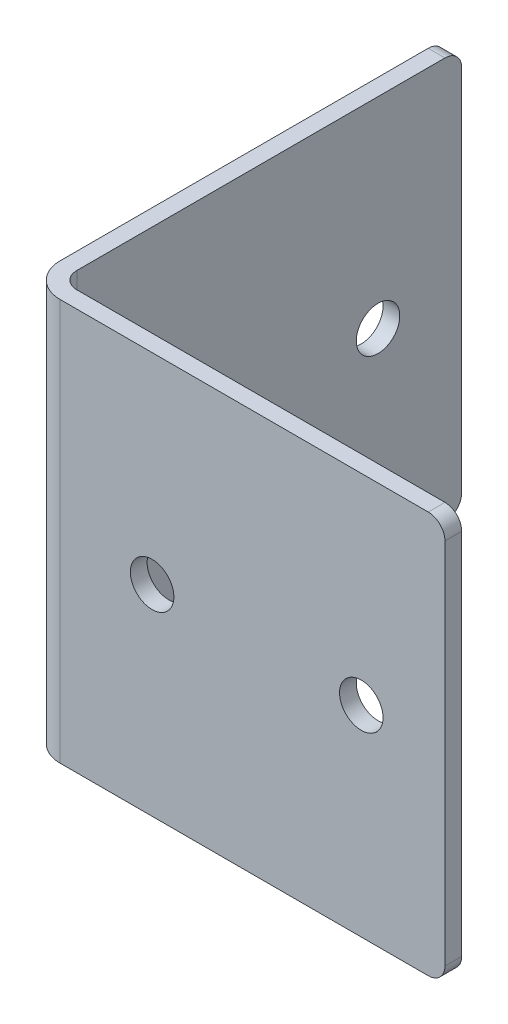
ISO-10303-21;
HEADER;
FILE_DESCRIPTION(('STEP AP214'),'2;1');
FILE_NAME('part.step','',(''),(''),'','','');
FILE_SCHEMA(('AUTOMOTIVE_DESIGN { 1 0 10303 214 1 1 1 1 }'));
ENDSEC;
DATA;
#1=APPLICATION_CONTEXT('core data for automotive mechanical design processes');
#2=APPLICATION_PROTOCOL_DEFINITION('international standard','automotive_design',2000,#1);
#3=PRODUCT_CONTEXT('',#1,'mechanical');
#4=PRODUCT('Part','Part','',(#3));
#5=PRODUCT_RELATED_PRODUCT_CATEGORY('part','',(#4));
#6=PRODUCT_DEFINITION_FORMATION('','',#4);
#7=PRODUCT_DEFINITION_CONTEXT('part definition',#1,'design');
#8=PRODUCT_DEFINITION('design','',#6,#7);
#9=PRODUCT_DEFINITION_SHAPE('','',#8);
#10=(LENGTH_UNIT() NAMED_UNIT(*) SI_UNIT(.MILLI.,.METRE.));
#11=(NAMED_UNIT(*) PLANE_ANGLE_UNIT() SI_UNIT($,.RADIAN.));
#12=(NAMED_UNIT(*) SI_UNIT($,.STERADIAN.) SOLID_ANGLE_UNIT());
#13=UNCERTAINTY_MEASURE_WITH_UNIT(LENGTH_MEASURE(1.E-05),#10,'distance_accuracy_value','');
#14=(GEOMETRIC_REPRESENTATION_CONTEXT(3) GLOBAL_UNCERTAINTY_ASSIGNED_CONTEXT((#13)) GLOBAL_UNIT_ASSIGNED_CONTEXT((#10,
#11,#12)) REPRESENTATION_CONTEXT('',''));
#15=CARTESIAN_POINT('',(0.,0.,0.));
#16=DIRECTION('',(0.,0.,1.));
#17=DIRECTION('',(1.,0.,0.));
#18=AXIS2_PLACEMENT_3D('',#15,#16,#17);
#19=CARTESIAN_POINT('',(2.,0.,0.));
#20=DIRECTION('',(1.,0.,0.));
#21=DIRECTION('',(0.,0.,-1.));
#22=AXIS2_PLACEMENT_3D('',#19,#20,#21);
#23=PLANE('',#22);
#24=DIRECTION('',(0.,0.,1.));
#25=VECTOR('',#24,1.);
#26=CARTESIAN_POINT('',(1.99999999999984,24.,-48.));
#27=LINE('',#26,#25);
#28=CARTESIAN_POINT('',(1.99999999999984,24.,-46.));
#29=VERTEX_POINT('',#28);
#30=CARTESIAN_POINT('',(1.99999999999992,24.,-1.99999999999999));
#31=VERTEX_POINT('',#30);
#32=EDGE_CURVE('E133',#29,#31,#27,.T.);
#33=ORIENTED_EDGE('',*,*,#32,.T.);
#34=DIRECTION('',(0.,1.,0.));
#35=VECTOR('',#34,1.);
#36=CARTESIAN_POINT('',(2.,24.,-1.99999999999999));
#37=LINE('',#36,#35);
#38=CARTESIAN_POINT('',(2.,-24.,-1.99999999999999));
#39=VERTEX_POINT('',#38);
#40=EDGE_CURVE('E139',#31,#39,#37,.F.);
#41=ORIENTED_EDGE('',*,*,#40,.T.);
#42=DIRECTION('',(0.,0.,1.));
#43=VECTOR('',#42,1.);
#44=CARTESIAN_POINT('',(2.,-24.,0.));
#45=LINE('',#44,#43);
#46=CARTESIAN_POINT('',(1.99999999999992,-24.,-46.));
#47=VERTEX_POINT('',#46);
#48=EDGE_CURVE('E124',#39,#47,#45,.F.);
#49=ORIENTED_EDGE('',*,*,#48,.T.);
#50=CARTESIAN_POINT('',(1.99999999999984,-22.,-46.));
#51=DIRECTION('',(1.,0.,0.));
#52=DIRECTION('',(0.,0.,-1.));
#53=AXIS2_PLACEMENT_3D('',#50,#51,#52);
#54=CIRCLE('',#53,2.);
#55=CARTESIAN_POINT('',(1.99999999999984,-22.,-48.));
#56=VERTEX_POINT('',#55);
#57=EDGE_CURVE('E120',#56,#47,#54,.F.);
#58=ORIENTED_EDGE('',*,*,#57,.F.);
#59=DIRECTION('',(0.,1.,0.));
#60=VECTOR('',#59,1.);
#61=CARTESIAN_POINT('',(1.99999999999984,-24.,-48.));
#62=LINE('',#61,#60);
#63=CARTESIAN_POINT('',(1.99999999999983,22.,-48.));
#64=VERTEX_POINT('',#63);
#65=EDGE_CURVE('E117',#56,#64,#62,.T.);
#66=ORIENTED_EDGE('',*,*,#65,.T.);
#67=CARTESIAN_POINT('',(1.99999999999984,22.,-46.));
#68=DIRECTION('',(1.,0.,0.));
#69=DIRECTION('',(0.,0.,-1.));
#70=AXIS2_PLACEMENT_3D('',#67,#68,#69);
#71=CIRCLE('',#70,2.);
#72=EDGE_CURVE('E104',#29,#64,#71,.F.);
#73=ORIENTED_EDGE('',*,*,#72,.F.);
#74=EDGE_LOOP('',(#33,#41,#49,#58,#66,#73));
#75=FACE_BOUND('',#74,.T.);
#76=CARTESIAN_POINT('',(1.99999999999995,0.,-13.));
#77=DIRECTION('',(-1.,0.,0.));
#78=DIRECTION('',(0.,0.,1.));
#79=AXIS2_PLACEMENT_3D('',#76,#77,#78);
#80=CIRCLE('',#79,2.6);
#81=CARTESIAN_POINT('',(1.99999999999996,0.,-10.4));
#82=VERTEX_POINT('',#81);
#83=EDGE_CURVE('E114',#82,#82,#80,.T.);
#84=ORIENTED_EDGE('',*,*,#83,.T.);
#85=EDGE_LOOP('',(#84));
#86=FACE_BOUND('',#85,.T.);
#87=CARTESIAN_POINT('',(1.99999999999987,0.,-38.));
#88=DIRECTION('',(-1.,0.,0.));
#89=DIRECTION('',(0.,0.,1.));
#90=AXIS2_PLACEMENT_3D('',#87,#88,#89);
#91=CIRCLE('',#90,2.6);
#92=CARTESIAN_POINT('',(1.99999999999988,0.,-35.4));
#93=VERTEX_POINT('',#92);
#94=EDGE_CURVE('E20',#93,#93,#91,.T.);
#95=ORIENTED_EDGE('',*,*,#94,.T.);
#96=EDGE_LOOP('',(#95));
#97=FACE_BOUND('',#96,.T.);
#98=ADVANCED_FACE('F17',(#75,#86,#97),#23,.T.);
#99=CARTESIAN_POINT('',(1.99999999999987,0.,-38.));
#100=DIRECTION('',(-1.,0.,0.));
#101=DIRECTION('',(0.,0.,1.));
#102=AXIS2_PLACEMENT_3D('',#99,#100,#101);
#103=CYLINDRICAL_SURFACE('',#102,2.6);
#104=ORIENTED_EDGE('',*,*,#94,.F.);
#105=EDGE_LOOP('',(#104));
#106=FACE_BOUND('',#105,.T.);
#107=CARTESIAN_POINT('',(-1.32706345912226E-13,0.,-38.));
#108=DIRECTION('',(-1.,0.,0.));
#109=DIRECTION('',(0.,0.,1.));
#110=AXIS2_PLACEMENT_3D('',#107,#108,#109);
#111=CIRCLE('',#110,2.6);
#112=CARTESIAN_POINT('',(-1.23628494431234E-13,0.,-35.4));
#113=VERTEX_POINT('',#112);
#114=EDGE_CURVE('E188',#113,#113,#111,.T.);
#115=ORIENTED_EDGE('',*,*,#114,.T.);
#116=EDGE_LOOP('',(#115));
#117=FACE_BOUND('',#116,.T.);
#118=ADVANCED_FACE('F198',(#106,#117),#103,.F.);
#119=CARTESIAN_POINT('',(1.99999999999995,0.,-13.));
#120=DIRECTION('',(-1.,0.,0.));
#121=DIRECTION('',(0.,0.,1.));
#122=AXIS2_PLACEMENT_3D('',#119,#120,#121);
#123=CYLINDRICAL_SURFACE('',#122,2.6);
#124=ORIENTED_EDGE('',*,*,#83,.F.);
#125=EDGE_LOOP('',(#124));
#126=FACE_BOUND('',#125,.T.);
#127=CARTESIAN_POINT('',(0.,0.,-13.));
#128=DIRECTION('',(-1.,0.,0.));
#129=DIRECTION('',(0.,0.,1.));
#130=AXIS2_PLACEMENT_3D('',#127,#128,#129);
#131=CIRCLE('',#130,2.6);
#132=CARTESIAN_POINT('',(0.,0.,-10.4));
#133=VERTEX_POINT('',#132);
#134=EDGE_CURVE('E185',#133,#133,#131,.T.);
#135=ORIENTED_EDGE('',*,*,#134,.T.);
#136=EDGE_LOOP('',(#135));
#137=FACE_BOUND('',#136,.T.);
#138=ADVANCED_FACE('F201',(#126,#137),#123,.F.);
#139=CARTESIAN_POINT('',(-1.6453110697825E-13,22.,-46.));
#140=DIRECTION('',(1.,0.,0.));
#141=DIRECTION('',(0.,0.,-1.));
#142=AXIS2_PLACEMENT_3D('',#139,#140,#141);
#143=CYLINDRICAL_SURFACE('',#142,2.);
#144=ORIENTED_EDGE('',*,*,#72,.T.);
#145=DIRECTION('',(1.,0.,0.));
#146=VECTOR('',#145,1.);
#147=CARTESIAN_POINT('',(-1.6306400674182E-13,22.,-48.));
#148=LINE('',#147,#146);
#149=CARTESIAN_POINT('',(-1.71632438701657E-13,22.,-48.));
#150=VERTEX_POINT('',#149);
#151=EDGE_CURVE('E109',#64,#150,#148,.F.);
#152=ORIENTED_EDGE('',*,*,#151,.T.);
#153=CARTESIAN_POINT('',(-1.6464947602397E-13,22.,-46.));
#154=DIRECTION('',(1.,0.,0.));
#155=DIRECTION('',(0.,0.,-1.));
#156=AXIS2_PLACEMENT_3D('',#153,#154,#155);
#157=CIRCLE('',#156,2.);
#158=CARTESIAN_POINT('',(-1.65016870063715E-13,24.,-46.));
#159=VERTEX_POINT('',#158);
#160=EDGE_CURVE('E182',#150,#159,#157,.T.);
#161=ORIENTED_EDGE('',*,*,#160,.T.);
#162=DIRECTION('',(1.,0.,0.));
#163=VECTOR('',#162,1.);
#164=CARTESIAN_POINT('',(-1.72171304990698E-13,24.,-46.));
#165=LINE('',#164,#163);
#166=EDGE_CURVE('E112',#159,#29,#165,.T.);
#167=ORIENTED_EDGE('',*,*,#166,.T.);
#168=EDGE_LOOP('',(#144,#152,#161,#167));
#169=FACE_BOUND('',#168,.T.);
#170=ADVANCED_FACE('F107',(#169),#143,.T.);
#171=CARTESIAN_POINT('',(-1.56638726936586E-13,-22.,-46.));
#172=DIRECTION('',(1.,0.,0.));
#173=DIRECTION('',(0.,0.,-1.));
#174=AXIS2_PLACEMENT_3D('',#171,#172,#173);
#175=CYLINDRICAL_SURFACE('',#174,2.);
#176=ORIENTED_EDGE('',*,*,#57,.T.);
#177=DIRECTION('',(-1.,0.,0.));
#178=VECTOR('',#177,1.);
#179=CARTESIAN_POINT('',(0.,-24.,-46.));
#180=LINE('',#179,#178);
#181=CARTESIAN_POINT('',(-1.56199413109854E-13,-24.,-46.));
#182=VERTEX_POINT('',#181);
#183=EDGE_CURVE('E137',#47,#182,#180,.T.);
#184=ORIENTED_EDGE('',*,*,#183,.T.);
#185=CARTESIAN_POINT('',(-1.56566807149598E-13,-22.,-46.));
#186=DIRECTION('',(1.,0.,0.));
#187=DIRECTION('',(0.,0.,-1.));
#188=AXIS2_PLACEMENT_3D('',#185,#186,#187);
#189=CIRCLE('',#188,2.);
#190=CARTESIAN_POINT('',(-1.63549769827284E-13,-22.,-48.));
#191=VERTEX_POINT('',#190);
#192=EDGE_CURVE('E179',#182,#191,#189,.T.);
#193=ORIENTED_EDGE('',*,*,#192,.T.);
#194=DIRECTION('',(1.,0.,0.));
#195=VECTOR('',#194,1.);
#196=CARTESIAN_POINT('',(-1.6306400674182E-13,-22.,-48.));
#197=LINE('',#196,#195);
#198=EDGE_CURVE('E125',#191,#56,#197,.T.);
#199=ORIENTED_EDGE('',*,*,#198,.T.);
#200=EDGE_LOOP('',(#176,#184,#193,#199));
#201=FACE_BOUND('',#200,.T.);
#202=ADVANCED_FACE('F348',(#201),#175,.T.);
#203=CARTESIAN_POINT('',(-1.6306400674182E-13,-24.,-48.));
#204=DIRECTION('',(0.,0.,1.));
#205=DIRECTION('',(1.,0.,0.));
#206=AXIS2_PLACEMENT_3D('',#203,#204,#205);
#207=PLANE('',#206);
#208=ORIENTED_EDGE('',*,*,#198,.F.);
#209=DIRECTION('',(0.,1.,0.));
#210=VECTOR('',#209,1.);
#211=CARTESIAN_POINT('',(-1.6759110426447E-13,0.,-48.));
#212=LINE('',#211,#210);
#213=EDGE_CURVE('E129',#191,#150,#212,.T.);
#214=ORIENTED_EDGE('',*,*,#213,.T.);
#215=ORIENTED_EDGE('',*,*,#151,.F.);
#216=ORIENTED_EDGE('',*,*,#65,.F.);
#217=EDGE_LOOP('',(#208,#214,#215,#216));
#218=FACE_BOUND('',#217,.T.);
#219=ADVANCED_FACE('F127',(#218),#207,.F.);
#220=CARTESIAN_POINT('',(3.99999999999999,24.,-2.));
#221=DIRECTION('',(0.,1.,0.));
#222=DIRECTION('',(0.,0.,1.));
#223=AXIS2_PLACEMENT_3D('',#220,#221,#222);
#224=CYLINDRICAL_SURFACE('',#223,2.);
#225=CARTESIAN_POINT('',(3.99999999999999,-24.,-2.));
#226=DIRECTION('',(0.,1.,0.));
#227=DIRECTION('',(0.,0.,1.));
#228=AXIS2_PLACEMENT_3D('',#225,#226,#227);
#229=CIRCLE('',#228,2.);
#230=CARTESIAN_POINT('',(3.99999999999999,-24.,0.));
#231=VERTEX_POINT('',#230);
#232=EDGE_CURVE('E176',#39,#231,#229,.T.);
#233=ORIENTED_EDGE('',*,*,#232,.F.);
#234=ORIENTED_EDGE('',*,*,#40,.F.);
#235=CARTESIAN_POINT('',(3.99999999999999,24.,-2.));
#236=DIRECTION('',(0.,1.,0.));
#237=DIRECTION('',(0.,0.,1.));
#238=AXIS2_PLACEMENT_3D('',#235,#236,#237);
#239=CIRCLE('',#238,2.);
#240=CARTESIAN_POINT('',(3.99999999999999,24.,0.));
#241=VERTEX_POINT('',#240);
#242=EDGE_CURVE('E191',#31,#241,#239,.T.);
#243=ORIENTED_EDGE('',*,*,#242,.T.);
#244=DIRECTION('',(0.,1.,0.));
#245=VECTOR('',#244,1.);
#246=CARTESIAN_POINT('',(3.99999999999999,0.,0.));
#247=LINE('',#246,#245);
#248=EDGE_CURVE('E175',#241,#231,#247,.F.);
#249=ORIENTED_EDGE('',*,*,#248,.T.);
#250=EDGE_LOOP('',(#233,#234,#243,#249));
#251=FACE_BOUND('',#250,.T.);
#252=ADVANCED_FACE('F207',(#251),#224,.F.);
#253=CARTESIAN_POINT('',(0.,0.,0.));
#254=DIRECTION('',(1.,0.,0.));
#255=DIRECTION('',(0.,0.,-1.));
#256=AXIS2_PLACEMENT_3D('',#253,#254,#255);
#257=PLANE('',#256);
#258=ORIENTED_EDGE('',*,*,#192,.F.);
#259=DIRECTION('',(0.,0.,-1.));
#260=VECTOR('',#259,1.);
#261=CARTESIAN_POINT('',(0.,-24.,0.));
#262=LINE('',#261,#260);
#263=CARTESIAN_POINT('',(0.,-24.,-1.99999999999999));
#264=VERTEX_POINT('',#263);
#265=EDGE_CURVE('E181',#264,#182,#262,.T.);
#266=ORIENTED_EDGE('',*,*,#265,.F.);
#267=DIRECTION('',(0.,1.,0.));
#268=VECTOR('',#267,1.);
#269=CARTESIAN_POINT('',(0.,24.,-1.99999999999999));
#270=LINE('',#269,#268);
#271=CARTESIAN_POINT('',(0.,24.,-1.99999999999999));
#272=VERTEX_POINT('',#271);
#273=EDGE_CURVE('E160',#272,#264,#270,.F.);
#274=ORIENTED_EDGE('',*,*,#273,.F.);
#275=DIRECTION('',(0.,0.,-1.));
#276=VECTOR('',#275,1.);
#277=CARTESIAN_POINT('',(0.,24.,0.));
#278=LINE('',#277,#276);
#279=EDGE_CURVE('E184',#159,#272,#278,.F.);
#280=ORIENTED_EDGE('',*,*,#279,.F.);
#281=ORIENTED_EDGE('',*,*,#160,.F.);
#282=ORIENTED_EDGE('',*,*,#213,.F.);
#283=EDGE_LOOP('',(#258,#266,#274,#280,#281,#282));
#284=FACE_BOUND('',#283,.T.);
#285=ORIENTED_EDGE('',*,*,#134,.F.);
#286=EDGE_LOOP('',(#285));
#287=FACE_BOUND('',#286,.T.);
#288=ORIENTED_EDGE('',*,*,#114,.F.);
#289=EDGE_LOOP('',(#288));
#290=FACE_BOUND('',#289,.T.);
#291=ADVANCED_FACE('F204',(#284,#287,#290),#257,.F.);
#292=CARTESIAN_POINT('',(0.,0.,0.));
#293=DIRECTION('',(0.,0.,1.));
#294=DIRECTION('',(1.,0.,0.));
#295=AXIS2_PLACEMENT_3D('',#292,#293,#294);
#296=PLANE('',#295);
#297=CARTESIAN_POINT('',(48.,22.,0.));
#298=DIRECTION('',(0.,0.,1.));
#299=DIRECTION('',(1.,0.,0.));
#300=AXIS2_PLACEMENT_3D('',#297,#298,#299);
#301=CIRCLE('',#300,2.);
#302=CARTESIAN_POINT('',(50.,22.,0.));
#303=VERTEX_POINT('',#302);
#304=CARTESIAN_POINT('',(48.,24.,0.));
#305=VERTEX_POINT('',#304);
#306=EDGE_CURVE('E165',#303,#305,#301,.T.);
#307=ORIENTED_EDGE('',*,*,#306,.F.);
#308=DIRECTION('',(0.,1.,0.));
#309=VECTOR('',#308,1.);
#310=CARTESIAN_POINT('',(50.,-24.,0.));
#311=LINE('',#310,#309);
#312=CARTESIAN_POINT('',(50.,-22.,0.));
#313=VERTEX_POINT('',#312);
#314=EDGE_CURVE('E168',#313,#303,#311,.T.);
#315=ORIENTED_EDGE('',*,*,#314,.F.);
#316=CARTESIAN_POINT('',(48.,-22.,0.));
#317=DIRECTION('',(0.,0.,1.));
#318=DIRECTION('',(1.,0.,0.));
#319=AXIS2_PLACEMENT_3D('',#316,#317,#318);
#320=CIRCLE('',#319,2.);
#321=CARTESIAN_POINT('',(48.,-24.,0.));
#322=VERTEX_POINT('',#321);
#323=EDGE_CURVE('E153',#322,#313,#320,.T.);
#324=ORIENTED_EDGE('',*,*,#323,.F.);
#325=DIRECTION('',(1.,0.,0.));
#326=VECTOR('',#325,1.);
#327=CARTESIAN_POINT('',(0.,-24.,0.));
#328=LINE('',#327,#326);
#329=EDGE_CURVE('E157',#231,#322,#328,.T.);
#330=ORIENTED_EDGE('',*,*,#329,.F.);
#331=ORIENTED_EDGE('',*,*,#248,.F.);
#332=DIRECTION('',(1.,0.,0.));
#333=VECTOR('',#332,1.);
#334=CARTESIAN_POINT('',(0.,24.,0.));
#335=LINE('',#334,#333);
#336=EDGE_CURVE('E164',#305,#241,#335,.F.);
#337=ORIENTED_EDGE('',*,*,#336,.F.);
#338=EDGE_LOOP('',(#307,#315,#324,#330,#331,#337));
#339=FACE_BOUND('',#338,.T.);
#340=CARTESIAN_POINT('',(15.,0.,0.));
#341=DIRECTION('',(0.,0.,1.));
#342=DIRECTION('',(1.,0.,0.));
#343=AXIS2_PLACEMENT_3D('',#340,#341,#342);
#344=CIRCLE('',#343,2.6);
#345=CARTESIAN_POINT('',(17.6,0.,0.));
#346=VERTEX_POINT('',#345);
#347=EDGE_CURVE('E172',#346,#346,#344,.T.);
#348=ORIENTED_EDGE('',*,*,#347,.T.);
#349=EDGE_LOOP('',(#348));
#350=FACE_BOUND('',#349,.T.);
#351=CARTESIAN_POINT('',(40.,0.,0.));
#352=DIRECTION('',(0.,0.,1.));
#353=DIRECTION('',(1.,0.,0.));
#354=AXIS2_PLACEMENT_3D('',#351,#352,#353);
#355=CIRCLE('',#354,2.6);
#356=CARTESIAN_POINT('',(42.6,0.,0.));
#357=VERTEX_POINT('',#356);
#358=EDGE_CURVE('E169',#357,#357,#355,.T.);
#359=ORIENTED_EDGE('',*,*,#358,.T.);
#360=EDGE_LOOP('',(#359));
#361=FACE_BOUND('',#360,.T.);
#362=ADVANCED_FACE('F206',(#339,#350,#361),#296,.F.);
#363=CARTESIAN_POINT('',(15.,0.,2.));
#364=DIRECTION('',(0.,0.,1.));
#365=DIRECTION('',(1.,0.,0.));
#366=AXIS2_PLACEMENT_3D('',#363,#364,#365);
#367=CYLINDRICAL_SURFACE('',#366,2.6);
#368=CARTESIAN_POINT('',(15.,0.,2.));
#369=DIRECTION('',(0.,0.,1.));
#370=DIRECTION('',(1.,0.,0.));
#371=AXIS2_PLACEMENT_3D('',#368,#369,#370);
#372=CIRCLE('',#371,2.6);
#373=CARTESIAN_POINT('',(17.6,0.,2.));
#374=VERTEX_POINT('',#373);
#375=EDGE_CURVE('E150',#374,#374,#372,.F.);
#376=ORIENTED_EDGE('',*,*,#375,.F.);
#377=EDGE_LOOP('',(#376));
#378=FACE_BOUND('',#377,.T.);
#379=ORIENTED_EDGE('',*,*,#347,.F.);
#380=EDGE_LOOP('',(#379));
#381=FACE_BOUND('',#380,.T.);
#382=ADVANCED_FACE('F215',(#378,#381),#367,.F.);
#383=CARTESIAN_POINT('',(40.,0.,2.));
#384=DIRECTION('',(0.,0.,1.));
#385=DIRECTION('',(1.,0.,0.));
#386=AXIS2_PLACEMENT_3D('',#383,#384,#385);
#387=CYLINDRICAL_SURFACE('',#386,2.6);
#388=CARTESIAN_POINT('',(40.,0.,2.));
#389=DIRECTION('',(0.,0.,1.));
#390=DIRECTION('',(1.,0.,0.));
#391=AXIS2_PLACEMENT_3D('',#388,#389,#390);
#392=CIRCLE('',#391,2.6);
#393=CARTESIAN_POINT('',(42.6,0.,2.));
#394=VERTEX_POINT('',#393);
#395=EDGE_CURVE('E147',#394,#394,#392,.F.);
#396=ORIENTED_EDGE('',*,*,#395,.F.);
#397=EDGE_LOOP('',(#396));
#398=FACE_BOUND('',#397,.T.);
#399=ORIENTED_EDGE('',*,*,#358,.F.);
#400=EDGE_LOOP('',(#399));
#401=FACE_BOUND('',#400,.T.);
#402=ADVANCED_FACE('F253',(#398,#401),#387,.F.);
#403=CARTESIAN_POINT('',(50.,-24.,2.));
#404=DIRECTION('',(1.,0.,0.));
#405=DIRECTION('',(0.,1.,0.));
#406=AXIS2_PLACEMENT_3D('',#403,#404,#405);
#407=PLANE('',#406);
#408=DIRECTION('',(0.,1.,0.));
#409=VECTOR('',#408,1.);
#410=CARTESIAN_POINT('',(50.,0.,2.));
#411=LINE('',#410,#409);
#412=CARTESIAN_POINT('',(50.,-22.,2.));
#413=VERTEX_POINT('',#412);
#414=CARTESIAN_POINT('',(50.,22.,2.));
#415=VERTEX_POINT('',#414);
#416=EDGE_CURVE('E146',#413,#415,#411,.T.);
#417=ORIENTED_EDGE('',*,*,#416,.F.);
#418=DIRECTION('',(0.,0.,1.));
#419=VECTOR('',#418,1.);
#420=CARTESIAN_POINT('',(50.,-22.,2.));
#421=LINE('',#420,#419);
#422=EDGE_CURVE('E156',#313,#413,#421,.T.);
#423=ORIENTED_EDGE('',*,*,#422,.F.);
#424=ORIENTED_EDGE('',*,*,#314,.T.);
#425=DIRECTION('',(0.,0.,1.));
#426=VECTOR('',#425,1.);
#427=CARTESIAN_POINT('',(50.,22.,2.));
#428=LINE('',#427,#426);
#429=EDGE_CURVE('E167',#415,#303,#428,.F.);
#430=ORIENTED_EDGE('',*,*,#429,.F.);
#431=EDGE_LOOP('',(#417,#423,#424,#430));
#432=FACE_BOUND('',#431,.T.);
#433=ADVANCED_FACE('F249',(#432),#407,.T.);
#434=CARTESIAN_POINT('',(48.,22.,2.));
#435=DIRECTION('',(0.,0.,1.));
#436=DIRECTION('',(1.,0.,0.));
#437=AXIS2_PLACEMENT_3D('',#434,#435,#436);
#438=CYLINDRICAL_SURFACE('',#437,2.);
#439=CARTESIAN_POINT('',(48.,22.,2.));
#440=DIRECTION('',(0.,0.,1.));
#441=DIRECTION('',(1.,0.,0.));
#442=AXIS2_PLACEMENT_3D('',#439,#440,#441);
#443=CIRCLE('',#442,2.);
#444=CARTESIAN_POINT('',(48.,24.,2.));
#445=VERTEX_POINT('',#444);
#446=EDGE_CURVE('E142',#415,#445,#443,.T.);
#447=ORIENTED_EDGE('',*,*,#446,.F.);
#448=ORIENTED_EDGE('',*,*,#429,.T.);
#449=ORIENTED_EDGE('',*,*,#306,.T.);
#450=DIRECTION('',(0.,0.,1.));
#451=VECTOR('',#450,1.);
#452=CARTESIAN_POINT('',(48.,24.,2.));
#453=LINE('',#452,#451);
#454=EDGE_CURVE('E414',#445,#305,#453,.F.);
#455=ORIENTED_EDGE('',*,*,#454,.F.);
#456=EDGE_LOOP('',(#447,#448,#449,#455));
#457=FACE_BOUND('',#456,.T.);
#458=ADVANCED_FACE('F245',(#457),#438,.T.);
#459=CARTESIAN_POINT('',(0.,24.,2.));
#460=DIRECTION('',(0.,1.,0.));
#461=DIRECTION('',(0.,0.,1.));
#462=AXIS2_PLACEMENT_3D('',#459,#460,#461);
#463=PLANE('',#462);
#464=ORIENTED_EDGE('',*,*,#336,.T.);
#465=ORIENTED_EDGE('',*,*,#242,.F.);
#466=ORIENTED_EDGE('',*,*,#32,.F.);
#467=ORIENTED_EDGE('',*,*,#166,.F.);
#468=ORIENTED_EDGE('',*,*,#279,.T.);
#469=CARTESIAN_POINT('',(3.99999999999999,24.,-2.));
#470=DIRECTION('',(0.,1.,0.));
#471=DIRECTION('',(0.,0.,1.));
#472=AXIS2_PLACEMENT_3D('',#469,#470,#471);
#473=CIRCLE('',#472,4.);
#474=CARTESIAN_POINT('',(3.99999999999999,24.,2.));
#475=VERTEX_POINT('',#474);
#476=EDGE_CURVE('E161',#475,#272,#473,.F.);
#477=ORIENTED_EDGE('',*,*,#476,.F.);
#478=DIRECTION('',(1.,0.,0.));
#479=VECTOR('',#478,1.);
#480=CARTESIAN_POINT('',(0.,24.,2.));
#481=LINE('',#480,#479);
#482=EDGE_CURVE('E145',#445,#475,#481,.F.);
#483=ORIENTED_EDGE('',*,*,#482,.F.);
#484=ORIENTED_EDGE('',*,*,#454,.T.);
#485=EDGE_LOOP('',(#464,#465,#466,#467,#468,#477,#483,#484));
#486=FACE_BOUND('',#485,.T.);
#487=ADVANCED_FACE('F241',(#486),#463,.T.);
#488=CARTESIAN_POINT('',(3.99999999999999,24.,-2.));
#489=DIRECTION('',(0.,1.,0.));
#490=DIRECTION('',(0.,0.,1.));
#491=AXIS2_PLACEMENT_3D('',#488,#489,#490);
#492=CYLINDRICAL_SURFACE('',#491,4.);
#493=ORIENTED_EDGE('',*,*,#273,.T.);
#494=CARTESIAN_POINT('',(3.99999999999999,-24.,-2.));
#495=DIRECTION('',(0.,1.,0.));
#496=DIRECTION('',(0.,0.,1.));
#497=AXIS2_PLACEMENT_3D('',#494,#495,#496);
#498=CIRCLE('',#497,4.);
#499=CARTESIAN_POINT('',(3.99999999999999,-24.,2.));
#500=VERTEX_POINT('',#499);
#501=EDGE_CURVE('E158',#264,#500,#498,.T.);
#502=ORIENTED_EDGE('',*,*,#501,.T.);
#503=DIRECTION('',(0.,1.,0.));
#504=VECTOR('',#503,1.);
#505=CARTESIAN_POINT('',(3.99999999999998,0.,2.));
#506=LINE('',#505,#504);
#507=EDGE_CURVE('E429',#475,#500,#506,.F.);
#508=ORIENTED_EDGE('',*,*,#507,.F.);
#509=ORIENTED_EDGE('',*,*,#476,.T.);
#510=EDGE_LOOP('',(#493,#502,#508,#509));
#511=FACE_BOUND('',#510,.T.);
#512=ADVANCED_FACE('F238',(#511),#492,.T.);
#513=CARTESIAN_POINT('',(0.,-24.,2.));
#514=DIRECTION('',(0.,-1.,0.));
#515=DIRECTION('',(0.,0.,-1.));
#516=AXIS2_PLACEMENT_3D('',#513,#514,#515);
#517=PLANE('',#516);
#518=DIRECTION('',(1.,0.,0.));
#519=VECTOR('',#518,1.);
#520=CARTESIAN_POINT('',(0.,-24.,2.));
#521=LINE('',#520,#519);
#522=CARTESIAN_POINT('',(48.,-24.,2.));
#523=VERTEX_POINT('',#522);
#524=EDGE_CURVE('E26',#500,#523,#521,.T.);
#525=ORIENTED_EDGE('',*,*,#524,.F.);
#526=ORIENTED_EDGE('',*,*,#501,.F.);
#527=ORIENTED_EDGE('',*,*,#265,.T.);
#528=ORIENTED_EDGE('',*,*,#183,.F.);
#529=ORIENTED_EDGE('',*,*,#48,.F.);
#530=ORIENTED_EDGE('',*,*,#232,.T.);
#531=ORIENTED_EDGE('',*,*,#329,.T.);
#532=DIRECTION('',(0.,0.,1.));
#533=VECTOR('',#532,1.);
#534=CARTESIAN_POINT('',(48.,-24.,2.));
#535=LINE('',#534,#533);
#536=EDGE_CURVE('E35',#523,#322,#535,.F.);
#537=ORIENTED_EDGE('',*,*,#536,.F.);
#538=EDGE_LOOP('',(#525,#526,#527,#528,#529,#530,#531,#537));
#539=FACE_BOUND('',#538,.T.);
#540=ADVANCED_FACE('F230',(#539),#517,.T.);
#541=CARTESIAN_POINT('',(48.,-22.,2.));
#542=DIRECTION('',(0.,0.,1.));
#543=DIRECTION('',(1.,0.,0.));
#544=AXIS2_PLACEMENT_3D('',#541,#542,#543);
#545=CYLINDRICAL_SURFACE('',#544,2.);
#546=CARTESIAN_POINT('',(48.,-22.,2.));
#547=DIRECTION('',(0.,0.,1.));
#548=DIRECTION('',(1.,0.,0.));
#549=AXIS2_PLACEMENT_3D('',#546,#547,#548);
#550=CIRCLE('',#549,2.);
#551=EDGE_CURVE('E11',#523,#413,#550,.T.);
#552=ORIENTED_EDGE('',*,*,#551,.F.);
#553=ORIENTED_EDGE('',*,*,#536,.T.);
#554=ORIENTED_EDGE('',*,*,#323,.T.);
#555=ORIENTED_EDGE('',*,*,#422,.T.);
#556=EDGE_LOOP('',(#552,#553,#554,#555));
#557=FACE_BOUND('',#556,.T.);
#558=ADVANCED_FACE('F224',(#557),#545,.T.);
#559=CARTESIAN_POINT('',(0.,0.,2.));
#560=DIRECTION('',(0.,0.,1.));
#561=DIRECTION('',(1.,0.,0.));
#562=AXIS2_PLACEMENT_3D('',#559,#560,#561);
#563=PLANE('',#562);
#564=ORIENTED_EDGE('',*,*,#524,.T.);
#565=ORIENTED_EDGE('',*,*,#551,.T.);
#566=ORIENTED_EDGE('',*,*,#416,.T.);
#567=ORIENTED_EDGE('',*,*,#446,.T.);
#568=ORIENTED_EDGE('',*,*,#482,.T.);
#569=ORIENTED_EDGE('',*,*,#507,.T.);
#570=EDGE_LOOP('',(#564,#565,#566,#567,#568,#569));
#571=FACE_BOUND('',#570,.T.);
#572=ORIENTED_EDGE('',*,*,#395,.T.);
#573=EDGE_LOOP('',(#572));
#574=FACE_BOUND('',#573,.T.);
#575=ORIENTED_EDGE('',*,*,#375,.T.);
#576=EDGE_LOOP('',(#575));
#577=FACE_BOUND('',#576,.T.);
#578=ADVANCED_FACE('F222',(#571,#574,#577),#563,.T.);
#579=CLOSED_SHELL('',(#98,#118,#138,#170,#202,#219,#252,#291,#362,#382,#402,#433,#458,#487,#512,
#540,#558,#578));
#580=MANIFOLD_SOLID_BREP('B1',#579);
#581=ADVANCED_BREP_SHAPE_REPRESENTATION('',(#18,#580),#14);
#582=SHAPE_DEFINITION_REPRESENTATION(#9,#581);
ENDSEC;
END-ISO-10303-21;
